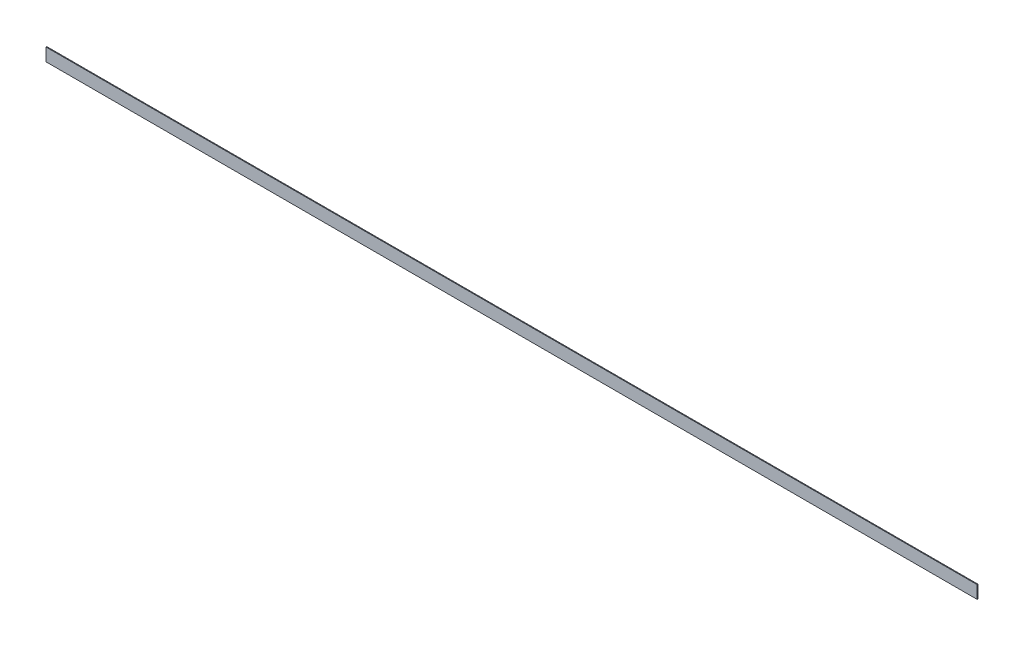
ISO-10303-21;
HEADER;
FILE_DESCRIPTION(('STEP AP214'),'2;1');
FILE_NAME('part.step','',(''),(''),'','','');
FILE_SCHEMA(('AUTOMOTIVE_DESIGN { 1 0 10303 214 1 1 1 1 }'));
ENDSEC;
DATA;
#1=APPLICATION_CONTEXT('core data for automotive mechanical design processes');
#2=APPLICATION_PROTOCOL_DEFINITION('international standard','automotive_design',2000,#1);
#3=PRODUCT_CONTEXT('',#1,'mechanical');
#4=PRODUCT('Part','Part','',(#3));
#5=PRODUCT_RELATED_PRODUCT_CATEGORY('part','',(#4));
#6=PRODUCT_DEFINITION_FORMATION('','',#4);
#7=PRODUCT_DEFINITION_CONTEXT('part definition',#1,'design');
#8=PRODUCT_DEFINITION('design','',#6,#7);
#9=PRODUCT_DEFINITION_SHAPE('','',#8);
#10=(LENGTH_UNIT() NAMED_UNIT(*) SI_UNIT(.MILLI.,.METRE.));
#11=(NAMED_UNIT(*) PLANE_ANGLE_UNIT() SI_UNIT($,.RADIAN.));
#12=(NAMED_UNIT(*) SI_UNIT($,.STERADIAN.) SOLID_ANGLE_UNIT());
#13=UNCERTAINTY_MEASURE_WITH_UNIT(LENGTH_MEASURE(1.E-05),#10,'distance_accuracy_value','');
#14=(GEOMETRIC_REPRESENTATION_CONTEXT(3) GLOBAL_UNCERTAINTY_ASSIGNED_CONTEXT((#13)) GLOBAL_UNIT_ASSIGNED_CONTEXT((#10,
#11,#12)) REPRESENTATION_CONTEXT('',''));
#15=CARTESIAN_POINT('',(0.,0.,0.));
#16=DIRECTION('',(0.,0.,1.));
#17=DIRECTION('',(1.,0.,0.));
#18=AXIS2_PLACEMENT_3D('',#15,#16,#17);
#19=CARTESIAN_POINT('',(-1844.675,-25.4,-3.175));
#20=DIRECTION('',(0.,0.,-1.));
#21=DIRECTION('',(-1.,0.,0.));
#22=AXIS2_PLACEMENT_3D('',#19,#20,#21);
#23=PLANE('',#22);
#24=DIRECTION('',(1.,0.,0.));
#25=VECTOR('',#24,1.);
#26=CARTESIAN_POINT('',(-1844.675,-25.4,-3.175));
#27=LINE('',#26,#25);
#28=CARTESIAN_POINT('',(-1844.675,-25.4,-3.175));
#29=VERTEX_POINT('',#28);
#30=CARTESIAN_POINT('',(1844.675,-25.4,-3.175));
#31=VERTEX_POINT('',#30);
#32=EDGE_CURVE('E20',#29,#31,#27,.T.);
#33=ORIENTED_EDGE('',*,*,#32,.F.);
#34=DIRECTION('',(0.,1.,0.));
#35=VECTOR('',#34,1.);
#36=CARTESIAN_POINT('',(-1844.675,0.,-3.175));
#37=LINE('',#36,#35);
#38=CARTESIAN_POINT('',(-1844.675,25.4,-3.175));
#39=VERTEX_POINT('',#38);
#40=EDGE_CURVE('E80',#29,#39,#37,.T.);
#41=ORIENTED_EDGE('',*,*,#40,.T.);
#42=DIRECTION('',(1.,0.,0.));
#43=VECTOR('',#42,1.);
#44=CARTESIAN_POINT('',(-1844.675,25.4,-3.175));
#45=LINE('',#44,#43);
#46=CARTESIAN_POINT('',(1844.675,25.4,-3.175));
#47=VERTEX_POINT('',#46);
#48=EDGE_CURVE('E68',#47,#39,#45,.F.);
#49=ORIENTED_EDGE('',*,*,#48,.F.);
#50=DIRECTION('',(0.,1.,0.));
#51=VECTOR('',#50,1.);
#52=CARTESIAN_POINT('',(1844.675,0.,-3.175));
#53=LINE('',#52,#51);
#54=EDGE_CURVE('E56',#31,#47,#53,.T.);
#55=ORIENTED_EDGE('',*,*,#54,.F.);
#56=EDGE_LOOP('',(#33,#41,#49,#55));
#57=FACE_BOUND('',#56,.T.);
#58=ADVANCED_FACE('F17',(#57),#23,.T.);
#59=CARTESIAN_POINT('',(-1844.675,-25.4,0.));
#60=DIRECTION('',(0.,-1.,0.));
#61=DIRECTION('',(0.,0.,-1.));
#62=AXIS2_PLACEMENT_3D('',#59,#60,#61);
#63=PLANE('',#62);
#64=DIRECTION('',(1.,0.,0.));
#65=VECTOR('',#64,1.);
#66=CARTESIAN_POINT('',(-1844.675,-25.4,0.));
#67=LINE('',#66,#65);
#68=CARTESIAN_POINT('',(-1844.675,-25.4,0.));
#69=VERTEX_POINT('',#68);
#70=CARTESIAN_POINT('',(1844.675,-25.4,0.));
#71=VERTEX_POINT('',#70);
#72=EDGE_CURVE('E83',#69,#71,#67,.T.);
#73=ORIENTED_EDGE('',*,*,#72,.F.);
#74=DIRECTION('',(0.,0.,-1.));
#75=VECTOR('',#74,1.);
#76=CARTESIAN_POINT('',(-1844.675,-25.4,0.));
#77=LINE('',#76,#75);
#78=EDGE_CURVE('E65',#69,#29,#77,.T.);
#79=ORIENTED_EDGE('',*,*,#78,.T.);
#80=ORIENTED_EDGE('',*,*,#32,.T.);
#81=DIRECTION('',(0.,0.,-1.));
#82=VECTOR('',#81,1.);
#83=CARTESIAN_POINT('',(1844.675,-25.4,0.));
#84=LINE('',#83,#82);
#85=EDGE_CURVE('E62',#71,#31,#84,.T.);
#86=ORIENTED_EDGE('',*,*,#85,.F.);
#87=EDGE_LOOP('',(#73,#79,#80,#86));
#88=FACE_BOUND('',#87,.T.);
#89=ADVANCED_FACE('F61',(#88),#63,.T.);
#90=CARTESIAN_POINT('',(1844.675,0.,0.));
#91=DIRECTION('',(1.,0.,0.));
#92=DIRECTION('',(0.,0.,-1.));
#93=AXIS2_PLACEMENT_3D('',#90,#91,#92);
#94=PLANE('',#93);
#95=DIRECTION('',(0.,0.,1.));
#96=VECTOR('',#95,1.);
#97=CARTESIAN_POINT('',(1844.675,25.4,-3.175));
#98=LINE('',#97,#96);
#99=CARTESIAN_POINT('',(1844.675,25.4,0.));
#100=VERTEX_POINT('',#99);
#101=EDGE_CURVE('E70',#100,#47,#98,.F.);
#102=ORIENTED_EDGE('',*,*,#101,.F.);
#103=DIRECTION('',(0.,1.,0.));
#104=VECTOR('',#103,1.);
#105=CARTESIAN_POINT('',(1844.675,25.4,0.));
#106=LINE('',#105,#104);
#107=EDGE_CURVE('E74',#71,#100,#106,.T.);
#108=ORIENTED_EDGE('',*,*,#107,.F.);
#109=ORIENTED_EDGE('',*,*,#85,.T.);
#110=ORIENTED_EDGE('',*,*,#54,.T.);
#111=EDGE_LOOP('',(#102,#108,#109,#110));
#112=FACE_BOUND('',#111,.T.);
#113=ADVANCED_FACE('F72',(#112),#94,.T.);
#114=CARTESIAN_POINT('',(-1844.675,25.4,-3.175));
#115=DIRECTION('',(0.,1.,0.));
#116=DIRECTION('',(0.,0.,1.));
#117=AXIS2_PLACEMENT_3D('',#114,#115,#116);
#118=PLANE('',#117);
#119=ORIENTED_EDGE('',*,*,#48,.T.);
#120=DIRECTION('',(0.,0.,-1.));
#121=VECTOR('',#120,1.);
#122=CARTESIAN_POINT('',(-1844.675,25.4,0.));
#123=LINE('',#122,#121);
#124=CARTESIAN_POINT('',(-1844.675,25.4,0.));
#125=VERTEX_POINT('',#124);
#126=EDGE_CURVE('E35',#39,#125,#123,.F.);
#127=ORIENTED_EDGE('',*,*,#126,.T.);
#128=DIRECTION('',(1.,0.,0.));
#129=VECTOR('',#128,1.);
#130=CARTESIAN_POINT('',(-1844.675,25.4,0.));
#131=LINE('',#130,#129);
#132=EDGE_CURVE('E26',#100,#125,#131,.F.);
#133=ORIENTED_EDGE('',*,*,#132,.F.);
#134=ORIENTED_EDGE('',*,*,#101,.T.);
#135=EDGE_LOOP('',(#119,#127,#133,#134));
#136=FACE_BOUND('',#135,.T.);
#137=ADVANCED_FACE('F89',(#136),#118,.T.);
#138=CARTESIAN_POINT('',(-1844.675,0.,0.));
#139=DIRECTION('',(1.,0.,0.));
#140=DIRECTION('',(0.,0.,-1.));
#141=AXIS2_PLACEMENT_3D('',#138,#139,#140);
#142=PLANE('',#141);
#143=ORIENTED_EDGE('',*,*,#40,.F.);
#144=ORIENTED_EDGE('',*,*,#78,.F.);
#145=DIRECTION('',(0.,1.,0.));
#146=VECTOR('',#145,1.);
#147=CARTESIAN_POINT('',(-1844.675,25.4,0.));
#148=LINE('',#147,#146);
#149=EDGE_CURVE('E11',#125,#69,#148,.F.);
#150=ORIENTED_EDGE('',*,*,#149,.F.);
#151=ORIENTED_EDGE('',*,*,#126,.F.);
#152=EDGE_LOOP('',(#143,#144,#150,#151));
#153=FACE_BOUND('',#152,.T.);
#154=ADVANCED_FACE('F91',(#153),#142,.F.);
#155=CARTESIAN_POINT('',(-1844.675,25.4,0.));
#156=DIRECTION('',(0.,0.,1.));
#157=DIRECTION('',(1.,0.,0.));
#158=AXIS2_PLACEMENT_3D('',#155,#156,#157);
#159=PLANE('',#158);
#160=ORIENTED_EDGE('',*,*,#132,.T.);
#161=ORIENTED_EDGE('',*,*,#149,.T.);
#162=ORIENTED_EDGE('',*,*,#72,.T.);
#163=ORIENTED_EDGE('',*,*,#107,.T.);
#164=EDGE_LOOP('',(#160,#161,#162,#163));
#165=FACE_BOUND('',#164,.T.);
#166=ADVANCED_FACE('F88',(#165),#159,.T.);
#167=CLOSED_SHELL('',(#58,#89,#113,#137,#154,#166));
#168=MANIFOLD_SOLID_BREP('B1',#167);
#169=ADVANCED_BREP_SHAPE_REPRESENTATION('',(#18,#168),#14);
#170=SHAPE_DEFINITION_REPRESENTATION(#9,#169);
ENDSEC;
END-ISO-10303-21;
